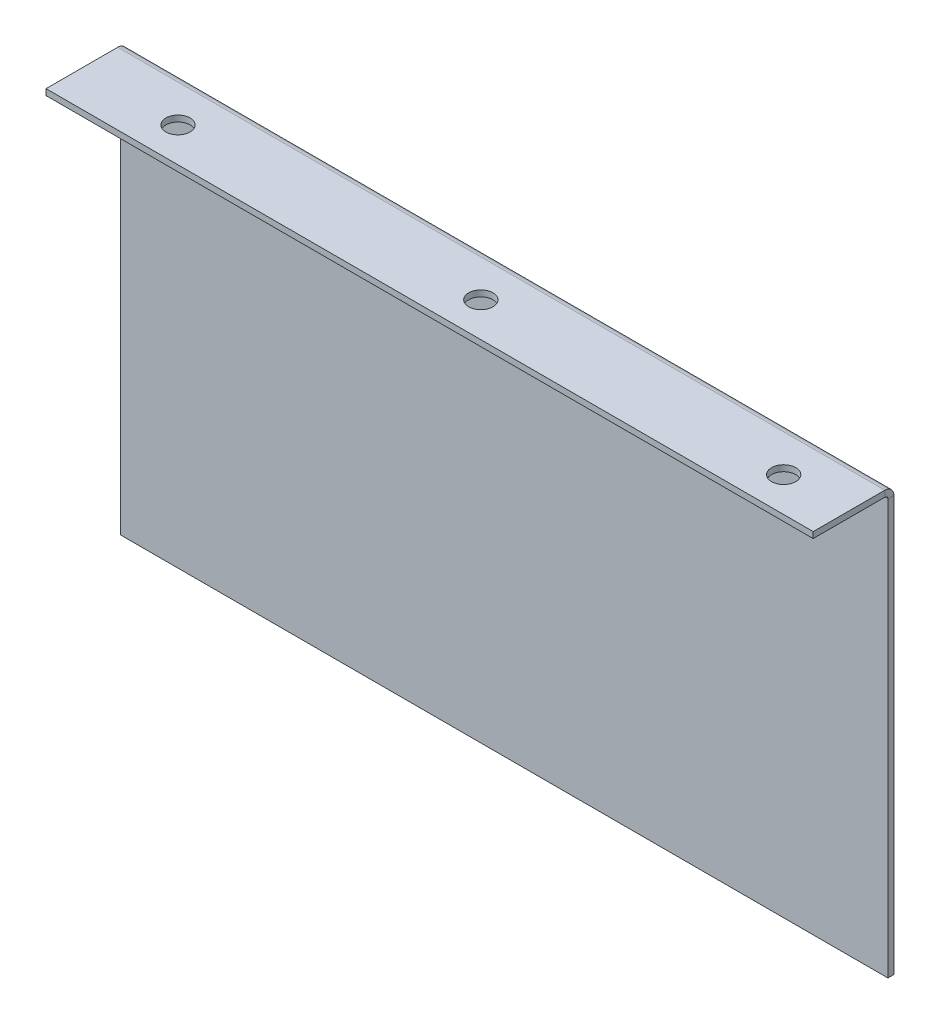
ISO-10303-21;
HEADER;
FILE_DESCRIPTION(('STEP AP214'),'2;1');
FILE_NAME('part.step','',(''),(''),'','','');
FILE_SCHEMA(('AUTOMOTIVE_DESIGN { 1 0 10303 214 1 1 1 1 }'));
ENDSEC;
DATA;
#1=APPLICATION_CONTEXT('core data for automotive mechanical design processes');
#2=APPLICATION_PROTOCOL_DEFINITION('international standard','automotive_design',2000,#1);
#3=PRODUCT_CONTEXT('',#1,'mechanical');
#4=PRODUCT('Part','Part','',(#3));
#5=PRODUCT_RELATED_PRODUCT_CATEGORY('part','',(#4));
#6=PRODUCT_DEFINITION_FORMATION('','',#4);
#7=PRODUCT_DEFINITION_CONTEXT('part definition',#1,'design');
#8=PRODUCT_DEFINITION('design','',#6,#7);
#9=PRODUCT_DEFINITION_SHAPE('','',#8);
#10=(LENGTH_UNIT() NAMED_UNIT(*) SI_UNIT(.MILLI.,.METRE.));
#11=(NAMED_UNIT(*) PLANE_ANGLE_UNIT() SI_UNIT($,.RADIAN.));
#12=(NAMED_UNIT(*) SI_UNIT($,.STERADIAN.) SOLID_ANGLE_UNIT());
#13=UNCERTAINTY_MEASURE_WITH_UNIT(LENGTH_MEASURE(1.E-05),#10,'distance_accuracy_value','');
#14=(GEOMETRIC_REPRESENTATION_CONTEXT(3) GLOBAL_UNCERTAINTY_ASSIGNED_CONTEXT((#13)) GLOBAL_UNIT_ASSIGNED_CONTEXT((#10,
#11,#12)) REPRESENTATION_CONTEXT('',''));
#15=CARTESIAN_POINT('',(0.,0.,0.));
#16=DIRECTION('',(0.,0.,1.));
#17=DIRECTION('',(1.,0.,0.));
#18=AXIS2_PLACEMENT_3D('',#15,#16,#17);
#19=CARTESIAN_POINT('',(72.0220053733779,57.2719298245614,9.94638227487143));
#20=DIRECTION('',(0.,-1.,0.));
#21=DIRECTION('',(0.,0.,-1.));
#22=AXIS2_PLACEMENT_3D('',#19,#20,#21);
#23=CYLINDRICAL_SURFACE('',#22,3.00499841539813);
#24=CARTESIAN_POINT('',(72.0220053733779,47.2719298245614,9.94638227487146));
#25=DIRECTION('',(0.,-1.,0.));
#26=DIRECTION('',(0.,0.,-1.));
#27=AXIS2_PLACEMENT_3D('',#24,#25,#26);
#28=CIRCLE('',#27,3.00499841539813);
#29=CARTESIAN_POINT('',(72.0220053733779,47.2719298245614,6.94138385947334));
#30=VERTEX_POINT('',#29);
#31=EDGE_CURVE('E66',#30,#30,#28,.T.);
#32=ORIENTED_EDGE('',*,*,#31,.T.);
#33=EDGE_LOOP('',(#32));
#34=FACE_BOUND('',#33,.T.);
#35=CARTESIAN_POINT('',(72.0220053733779,48.7719298245614,9.94638227487146));
#36=DIRECTION('',(0.,-1.,0.));
#37=DIRECTION('',(0.,0.,-1.));
#38=AXIS2_PLACEMENT_3D('',#35,#36,#37);
#39=CIRCLE('',#38,3.00499841539813);
#40=CARTESIAN_POINT('',(72.0220053733779,48.7719298245614,6.94138385947333));
#41=VERTEX_POINT('',#40);
#42=EDGE_CURVE('E13',#41,#41,#39,.T.);
#43=ORIENTED_EDGE('',*,*,#42,.F.);
#44=EDGE_LOOP('',(#43));
#45=FACE_BOUND('',#44,.T.);
#46=ADVANCED_FACE('F59',(#34,#45),#23,.F.);
#47=CARTESIAN_POINT('',(-102.105263157895,48.7719298245614,-1.5));
#48=DIRECTION('',(-1.,0.,0.));
#49=DIRECTION('',(0.,-1.,0.));
#50=AXIS2_PLACEMENT_3D('',#47,#48,#49);
#51=PLANE('',#50);
#52=DIRECTION('',(0.,-1.,0.));
#53=VECTOR('',#52,1.);
#54=CARTESIAN_POINT('',(-102.105263157895,48.7719298245614,0.));
#55=LINE('',#54,#53);
#56=CARTESIAN_POINT('',(-102.105263157895,46.5353298245614,0.));
#57=VERTEX_POINT('',#56);
#58=CARTESIAN_POINT('',(-102.105263157895,-56.2280701754386,0.));
#59=VERTEX_POINT('',#58);
#60=EDGE_CURVE('E111',#57,#59,#55,.T.);
#61=ORIENTED_EDGE('',*,*,#60,.F.);
#62=DIRECTION('',(0.,0.,-1.));
#63=VECTOR('',#62,1.);
#64=CARTESIAN_POINT('',(-102.105263157895,46.5353298245614,0.));
#65=LINE('',#64,#63);
#66=CARTESIAN_POINT('',(-102.105263157895,46.5353298245614,-1.5));
#67=VERTEX_POINT('',#66);
#68=EDGE_CURVE('E236',#57,#67,#65,.T.);
#69=ORIENTED_EDGE('',*,*,#68,.T.);
#70=DIRECTION('',(0.,-1.,0.));
#71=VECTOR('',#70,1.);
#72=CARTESIAN_POINT('',(-102.105263157895,48.7719298245614,-1.5));
#73=LINE('',#72,#71);
#74=CARTESIAN_POINT('',(-102.105263157895,-56.2280701754386,-1.5));
#75=VERTEX_POINT('',#74);
#76=EDGE_CURVE('E108',#67,#75,#73,.T.);
#77=ORIENTED_EDGE('',*,*,#76,.T.);
#78=DIRECTION('',(0.,0.,1.));
#79=VECTOR('',#78,1.);
#80=CARTESIAN_POINT('',(-102.105263157895,-56.2280701754386,-1.5));
#81=LINE('',#80,#79);
#82=EDGE_CURVE('E100',#75,#59,#81,.T.);
#83=ORIENTED_EDGE('',*,*,#82,.T.);
#84=EDGE_LOOP('',(#61,#69,#77,#83));
#85=FACE_BOUND('',#84,.T.);
#86=ADVANCED_FACE('F142',(#85),#51,.T.);
#87=CARTESIAN_POINT('',(0.,0.,-1.5));
#88=DIRECTION('',(0.,0.,1.));
#89=DIRECTION('',(1.,0.,0.));
#90=AXIS2_PLACEMENT_3D('',#87,#88,#89);
#91=PLANE('',#90);
#92=DIRECTION('',(-1.,0.,0.));
#93=VECTOR('',#92,1.);
#94=CARTESIAN_POINT('',(-102.105263157895,46.5353298245614,-1.5));
#95=LINE('',#94,#93);
#96=CARTESIAN_POINT('',(87.8947368421053,46.5353298245614,-1.5));
#97=VERTEX_POINT('',#96);
#98=EDGE_CURVE('E229',#67,#97,#95,.F.);
#99=ORIENTED_EDGE('',*,*,#98,.T.);
#100=DIRECTION('',(0.,1.,0.));
#101=VECTOR('',#100,1.);
#102=CARTESIAN_POINT('',(87.8947368421053,48.7719298245614,-1.5));
#103=LINE('',#102,#101);
#104=CARTESIAN_POINT('',(87.8947368421053,-56.2280701754386,-1.5));
#105=VERTEX_POINT('',#104);
#106=EDGE_CURVE('E117',#105,#97,#103,.T.);
#107=ORIENTED_EDGE('',*,*,#106,.F.);
#108=DIRECTION('',(1.,0.,0.));
#109=VECTOR('',#108,1.);
#110=CARTESIAN_POINT('',(-102.105263157895,-56.2280701754386,-1.5));
#111=LINE('',#110,#109);
#112=EDGE_CURVE('E99',#75,#105,#111,.T.);
#113=ORIENTED_EDGE('',*,*,#112,.F.);
#114=ORIENTED_EDGE('',*,*,#76,.F.);
#115=EDGE_LOOP('',(#99,#107,#113,#114));
#116=FACE_BOUND('',#115,.T.);
#117=ADVANCED_FACE('F146',(#116),#91,.F.);
#118=CARTESIAN_POINT('',(0.,0.,0.));
#119=DIRECTION('',(0.,0.,1.));
#120=DIRECTION('',(1.,0.,0.));
#121=AXIS2_PLACEMENT_3D('',#118,#119,#120);
#122=PLANE('',#121);
#123=DIRECTION('',(0.,1.,0.));
#124=VECTOR('',#123,1.);
#125=CARTESIAN_POINT('',(87.8947368421053,48.7719298245614,0.));
#126=LINE('',#125,#124);
#127=CARTESIAN_POINT('',(87.8947368421053,-56.2280701754386,0.));
#128=VERTEX_POINT('',#127);
#129=CARTESIAN_POINT('',(87.8947368421053,46.5353298245614,0.));
#130=VERTEX_POINT('',#129);
#131=EDGE_CURVE('E103',#128,#130,#126,.T.);
#132=ORIENTED_EDGE('',*,*,#131,.T.);
#133=DIRECTION('',(-1.,0.,0.));
#134=VECTOR('',#133,1.);
#135=CARTESIAN_POINT('',(-102.105263157895,46.5353298245614,0.));
#136=LINE('',#135,#134);
#137=EDGE_CURVE('E73',#57,#130,#136,.F.);
#138=ORIENTED_EDGE('',*,*,#137,.F.);
#139=ORIENTED_EDGE('',*,*,#60,.T.);
#140=DIRECTION('',(1.,0.,0.));
#141=VECTOR('',#140,1.);
#142=CARTESIAN_POINT('',(-102.105263157895,-56.2280701754386,0.));
#143=LINE('',#142,#141);
#144=EDGE_CURVE('E97',#59,#128,#143,.T.);
#145=ORIENTED_EDGE('',*,*,#144,.T.);
#146=EDGE_LOOP('',(#132,#138,#139,#145));
#147=FACE_BOUND('',#146,.T.);
#148=ADVANCED_FACE('F110',(#147),#122,.T.);
#149=CARTESIAN_POINT('',(87.8947368421053,48.7719298245614,-1.5));
#150=DIRECTION('',(1.,0.,0.));
#151=DIRECTION('',(0.,1.,0.));
#152=AXIS2_PLACEMENT_3D('',#149,#150,#151);
#153=PLANE('',#152);
#154=DIRECTION('',(0.,0.,-1.));
#155=VECTOR('',#154,1.);
#156=CARTESIAN_POINT('',(87.8947368421053,46.5353298245614,0.));
#157=LINE('',#156,#155);
#158=EDGE_CURVE('E107',#130,#97,#157,.T.);
#159=ORIENTED_EDGE('',*,*,#158,.F.);
#160=ORIENTED_EDGE('',*,*,#131,.F.);
#161=DIRECTION('',(0.,0.,1.));
#162=VECTOR('',#161,1.);
#163=CARTESIAN_POINT('',(87.8947368421053,-56.2280701754386,-1.5));
#164=LINE('',#163,#162);
#165=EDGE_CURVE('E82',#105,#128,#164,.T.);
#166=ORIENTED_EDGE('',*,*,#165,.F.);
#167=ORIENTED_EDGE('',*,*,#106,.T.);
#168=EDGE_LOOP('',(#159,#160,#166,#167));
#169=FACE_BOUND('',#168,.T.);
#170=ADVANCED_FACE('F104',(#169),#153,.T.);
#171=CARTESIAN_POINT('',(-102.105263157895,-56.2280701754386,-1.5));
#172=DIRECTION('',(0.,-1.,0.));
#173=DIRECTION('',(0.,0.,-1.));
#174=AXIS2_PLACEMENT_3D('',#171,#172,#173);
#175=PLANE('',#174);
#176=ORIENTED_EDGE('',*,*,#144,.F.);
#177=ORIENTED_EDGE('',*,*,#82,.F.);
#178=ORIENTED_EDGE('',*,*,#112,.T.);
#179=ORIENTED_EDGE('',*,*,#165,.T.);
#180=EDGE_LOOP('',(#176,#177,#178,#179));
#181=FACE_BOUND('',#180,.T.);
#182=ADVANCED_FACE('F94',(#181),#175,.T.);
#183=CARTESIAN_POINT('',(87.8947368421053,46.5353298245614,0.736599999999996));
#184=DIRECTION('',(1.,0.,0.));
#185=DIRECTION('',(0.,0.,-1.));
#186=AXIS2_PLACEMENT_3D('',#183,#184,#185);
#187=PLANE('',#186);
#188=DIRECTION('',(0.,-1.,0.));
#189=VECTOR('',#188,1.);
#190=CARTESIAN_POINT('',(87.8947368421053,48.7719298245614,0.736599999999992));
#191=LINE('',#190,#189);
#192=CARTESIAN_POINT('',(87.8947368421053,47.2719298245614,0.736599999999993));
#193=VERTEX_POINT('',#192);
#194=CARTESIAN_POINT('',(87.8947368421053,48.7719298245614,0.736599999999988));
#195=VERTEX_POINT('',#194);
#196=EDGE_CURVE('E225',#193,#195,#191,.F.);
#197=ORIENTED_EDGE('',*,*,#196,.F.);
#198=CARTESIAN_POINT('',(87.8947368421053,46.5353298245614,0.736599999999996));
#199=DIRECTION('',(-1.,0.,0.));
#200=DIRECTION('',(0.,0.,1.));
#201=AXIS2_PLACEMENT_3D('',#198,#199,#200);
#202=CIRCLE('',#201,0.736599999999997);
#203=EDGE_CURVE('E238',#130,#193,#202,.F.);
#204=ORIENTED_EDGE('',*,*,#203,.F.);
#205=ORIENTED_EDGE('',*,*,#158,.T.);
#206=CARTESIAN_POINT('',(87.8947368421053,46.5353298245614,0.736599999999996));
#207=DIRECTION('',(-1.,0.,0.));
#208=DIRECTION('',(0.,0.,1.));
#209=AXIS2_PLACEMENT_3D('',#206,#207,#208);
#210=CIRCLE('',#209,2.2366);
#211=EDGE_CURVE('E232',#97,#195,#210,.F.);
#212=ORIENTED_EDGE('',*,*,#211,.T.);
#213=EDGE_LOOP('',(#197,#204,#205,#212));
#214=FACE_BOUND('',#213,.T.);
#215=ADVANCED_FACE('F156',(#214),#187,.T.);
#216=CARTESIAN_POINT('',(-102.105263157895,46.5353298245614,0.736599999999996));
#217=DIRECTION('',(1.,0.,0.));
#218=DIRECTION('',(0.,0.,-1.));
#219=AXIS2_PLACEMENT_3D('',#216,#217,#218);
#220=PLANE('',#219);
#221=CARTESIAN_POINT('',(-102.105263157895,46.5353298245614,0.736599999999996));
#222=DIRECTION('',(-1.,0.,0.));
#223=DIRECTION('',(0.,0.,1.));
#224=AXIS2_PLACEMENT_3D('',#221,#222,#223);
#225=CIRCLE('',#224,0.736599999999997);
#226=CARTESIAN_POINT('',(-102.105263157895,47.2719298245614,0.736599999999993));
#227=VERTEX_POINT('',#226);
#228=EDGE_CURVE('E242',#227,#57,#225,.T.);
#229=ORIENTED_EDGE('',*,*,#228,.F.);
#230=DIRECTION('',(0.,-1.,0.));
#231=VECTOR('',#230,1.);
#232=CARTESIAN_POINT('',(-102.105263157895,47.2719298245614,0.73659999999999));
#233=LINE('',#232,#231);
#234=CARTESIAN_POINT('',(-102.105263157895,48.7719298245614,0.736599999999985));
#235=VERTEX_POINT('',#234);
#236=EDGE_CURVE('E189',#227,#235,#233,.F.);
#237=ORIENTED_EDGE('',*,*,#236,.T.);
#238=CARTESIAN_POINT('',(-102.105263157895,46.5353298245614,0.736599999999996));
#239=DIRECTION('',(-1.,0.,0.));
#240=DIRECTION('',(0.,0.,1.));
#241=AXIS2_PLACEMENT_3D('',#238,#239,#240);
#242=CIRCLE('',#241,2.2366);
#243=EDGE_CURVE('E233',#235,#67,#242,.T.);
#244=ORIENTED_EDGE('',*,*,#243,.T.);
#245=ORIENTED_EDGE('',*,*,#68,.F.);
#246=EDGE_LOOP('',(#229,#237,#244,#245));
#247=FACE_BOUND('',#246,.T.);
#248=ADVANCED_FACE('F161',(#247),#220,.F.);
#249=CARTESIAN_POINT('',(-102.105263157895,46.5353298245614,0.736599999999996));
#250=DIRECTION('',(-1.,0.,0.));
#251=DIRECTION('',(0.,1.,0.));
#252=AXIS2_PLACEMENT_3D('',#249,#250,#251);
#253=CYLINDRICAL_SURFACE('',#252,2.2366);
#254=ORIENTED_EDGE('',*,*,#98,.F.);
#255=ORIENTED_EDGE('',*,*,#243,.F.);
#256=DIRECTION('',(-1.,0.,0.));
#257=VECTOR('',#256,1.);
#258=CARTESIAN_POINT('',(87.8947368421053,48.7719298245614,0.736599999999992));
#259=LINE('',#258,#257);
#260=EDGE_CURVE('E205',#235,#195,#259,.F.);
#261=ORIENTED_EDGE('',*,*,#260,.T.);
#262=ORIENTED_EDGE('',*,*,#211,.F.);
#263=EDGE_LOOP('',(#254,#255,#261,#262));
#264=FACE_BOUND('',#263,.T.);
#265=ADVANCED_FACE('F164',(#264),#253,.T.);
#266=CARTESIAN_POINT('',(-102.105263157895,46.5353298245614,0.736599999999996));
#267=DIRECTION('',(-1.,0.,0.));
#268=DIRECTION('',(0.,1.,0.));
#269=AXIS2_PLACEMENT_3D('',#266,#267,#268);
#270=CYLINDRICAL_SURFACE('',#269,0.736599999999997);
#271=ORIENTED_EDGE('',*,*,#137,.T.);
#272=ORIENTED_EDGE('',*,*,#203,.T.);
#273=DIRECTION('',(-1.,0.,0.));
#274=VECTOR('',#273,1.);
#275=CARTESIAN_POINT('',(87.8947368421053,47.2719298245614,0.736599999999997));
#276=LINE('',#275,#274);
#277=EDGE_CURVE('E206',#193,#227,#276,.T.);
#278=ORIENTED_EDGE('',*,*,#277,.T.);
#279=ORIENTED_EDGE('',*,*,#228,.T.);
#280=EDGE_LOOP('',(#271,#272,#278,#279));
#281=FACE_BOUND('',#280,.T.);
#282=ADVANCED_FACE('F169',(#281),#270,.F.);
#283=CARTESIAN_POINT('',(87.8947368421053,48.7719298245614,0.));
#284=DIRECTION('',(-1.,0.,0.));
#285=DIRECTION('',(0.,0.,1.));
#286=AXIS2_PLACEMENT_3D('',#283,#284,#285);
#287=PLANE('',#286);
#288=ORIENTED_EDGE('',*,*,#196,.T.);
#289=DIRECTION('',(0.,0.,-1.));
#290=VECTOR('',#289,1.);
#291=CARTESIAN_POINT('',(87.8947368421053,48.7719298245614,-1.6987555816356E-13));
#292=LINE('',#291,#290);
#293=CARTESIAN_POINT('',(87.8947368421053,48.7719298245615,18.5));
#294=VERTEX_POINT('',#293);
#295=EDGE_CURVE('E217',#294,#195,#292,.T.);
#296=ORIENTED_EDGE('',*,*,#295,.F.);
#297=DIRECTION('',(0.,-1.,0.));
#298=VECTOR('',#297,1.);
#299=CARTESIAN_POINT('',(87.8947368421053,48.7719298245615,18.5));
#300=LINE('',#299,#298);
#301=CARTESIAN_POINT('',(87.8947368421053,47.2719298245615,18.5));
#302=VERTEX_POINT('',#301);
#303=EDGE_CURVE('E278',#294,#302,#300,.T.);
#304=ORIENTED_EDGE('',*,*,#303,.T.);
#305=DIRECTION('',(0.,0.,1.));
#306=VECTOR('',#305,1.);
#307=CARTESIAN_POINT('',(87.8947368421053,47.2719298245614,0.));
#308=LINE('',#307,#306);
#309=EDGE_CURVE('E215',#302,#193,#308,.F.);
#310=ORIENTED_EDGE('',*,*,#309,.T.);
#311=EDGE_LOOP('',(#288,#296,#304,#310));
#312=FACE_BOUND('',#311,.T.);
#313=ADVANCED_FACE('F172',(#312),#287,.F.);
#314=CARTESIAN_POINT('',(-102.105263157895,48.7719298245615,18.5));
#315=DIRECTION('',(1.,0.,0.));
#316=DIRECTION('',(0.,0.,-1.));
#317=AXIS2_PLACEMENT_3D('',#314,#315,#316);
#318=PLANE('',#317);
#319=ORIENTED_EDGE('',*,*,#236,.F.);
#320=DIRECTION('',(0.,0.,-1.));
#321=VECTOR('',#320,1.);
#322=CARTESIAN_POINT('',(-102.105263157895,47.2719298245615,18.5));
#323=LINE('',#322,#321);
#324=CARTESIAN_POINT('',(-102.105263157895,47.2719298245615,18.5));
#325=VERTEX_POINT('',#324);
#326=EDGE_CURVE('E193',#227,#325,#323,.F.);
#327=ORIENTED_EDGE('',*,*,#326,.T.);
#328=DIRECTION('',(0.,-1.,0.));
#329=VECTOR('',#328,1.);
#330=CARTESIAN_POINT('',(-102.105263157895,48.7719298245615,18.5));
#331=LINE('',#330,#329);
#332=CARTESIAN_POINT('',(-102.105263157895,48.7719298245615,18.5));
#333=VERTEX_POINT('',#332);
#334=EDGE_CURVE('E245',#333,#325,#331,.T.);
#335=ORIENTED_EDGE('',*,*,#334,.F.);
#336=DIRECTION('',(0.,0.,1.));
#337=VECTOR('',#336,1.);
#338=CARTESIAN_POINT('',(-102.105263157895,48.7719298245614,-1.6987555816356E-13));
#339=LINE('',#338,#337);
#340=EDGE_CURVE('E197',#235,#333,#339,.T.);
#341=ORIENTED_EDGE('',*,*,#340,.F.);
#342=EDGE_LOOP('',(#319,#327,#335,#341));
#343=FACE_BOUND('',#342,.T.);
#344=ADVANCED_FACE('F136',(#343),#318,.F.);
#345=CARTESIAN_POINT('',(0.,48.7719298245614,-1.6987555816356E-13));
#346=DIRECTION('',(0.,-1.,0.));
#347=DIRECTION('',(0.,0.,-1.));
#348=AXIS2_PLACEMENT_3D('',#345,#346,#347);
#349=PLANE('',#348);
#350=CARTESIAN_POINT('',(-2.97799462662214,48.7719298245614,9.94638227487146));
#351=DIRECTION('',(0.,-1.,0.));
#352=DIRECTION('',(0.,0.,-1.));
#353=AXIS2_PLACEMENT_3D('',#350,#351,#352);
#354=CIRCLE('',#353,3.00499841539813);
#355=CARTESIAN_POINT('',(-2.97799462662214,48.7719298245614,6.94138385947333));
#356=VERTEX_POINT('',#355);
#357=EDGE_CURVE('E289',#356,#356,#354,.T.);
#358=ORIENTED_EDGE('',*,*,#357,.T.);
#359=EDGE_LOOP('',(#358));
#360=FACE_BOUND('',#359,.T.);
#361=CARTESIAN_POINT('',(-77.9779946266221,48.7719298245614,9.94638227487146));
#362=DIRECTION('',(0.,-1.,0.));
#363=DIRECTION('',(0.,0.,-1.));
#364=AXIS2_PLACEMENT_3D('',#361,#362,#363);
#365=CIRCLE('',#364,3.00499841539813);
#366=CARTESIAN_POINT('',(-77.9779946266221,48.7719298245614,6.94138385947333));
#367=VERTEX_POINT('',#366);
#368=EDGE_CURVE('E228',#367,#367,#365,.T.);
#369=ORIENTED_EDGE('',*,*,#368,.T.);
#370=EDGE_LOOP('',(#369));
#371=FACE_BOUND('',#370,.T.);
#372=ORIENTED_EDGE('',*,*,#260,.F.);
#373=ORIENTED_EDGE('',*,*,#340,.T.);
#374=DIRECTION('',(1.,0.,0.));
#375=VECTOR('',#374,1.);
#376=CARTESIAN_POINT('',(0.,48.7719298245615,18.5));
#377=LINE('',#376,#375);
#378=EDGE_CURVE('E274',#333,#294,#377,.T.);
#379=ORIENTED_EDGE('',*,*,#378,.T.);
#380=ORIENTED_EDGE('',*,*,#295,.T.);
#381=EDGE_LOOP('',(#372,#373,#379,#380));
#382=FACE_BOUND('',#381,.T.);
#383=ORIENTED_EDGE('',*,*,#42,.T.);
#384=EDGE_LOOP('',(#383));
#385=FACE_BOUND('',#384,.T.);
#386=ADVANCED_FACE('F126',(#360,#371,#382,#385),#349,.F.);
#387=CARTESIAN_POINT('',(0.,47.2719298245614,-1.64638336155295E-13));
#388=DIRECTION('',(0.,-1.,0.));
#389=DIRECTION('',(0.,0.,-1.));
#390=AXIS2_PLACEMENT_3D('',#387,#388,#389);
#391=PLANE('',#390);
#392=CARTESIAN_POINT('',(-2.97799462662214,47.2719298245614,9.94638227487146));
#393=DIRECTION('',(0.,-1.,0.));
#394=DIRECTION('',(0.,0.,-1.));
#395=AXIS2_PLACEMENT_3D('',#392,#393,#394);
#396=CIRCLE('',#395,3.00499841539813);
#397=CARTESIAN_POINT('',(-2.97799462662214,47.2719298245614,6.94138385947334));
#398=VERTEX_POINT('',#397);
#399=EDGE_CURVE('E292',#398,#398,#396,.T.);
#400=ORIENTED_EDGE('',*,*,#399,.F.);
#401=EDGE_LOOP('',(#400));
#402=FACE_BOUND('',#401,.T.);
#403=CARTESIAN_POINT('',(-77.9779946266221,47.2719298245614,9.94638227487146));
#404=DIRECTION('',(0.,-1.,0.));
#405=DIRECTION('',(0.,0.,-1.));
#406=AXIS2_PLACEMENT_3D('',#403,#404,#405);
#407=CIRCLE('',#406,3.00499841539813);
#408=CARTESIAN_POINT('',(-77.9779946266221,47.2719298245614,6.94138385947334));
#409=VERTEX_POINT('',#408);
#410=EDGE_CURVE('E286',#409,#409,#407,.T.);
#411=ORIENTED_EDGE('',*,*,#410,.F.);
#412=EDGE_LOOP('',(#411));
#413=FACE_BOUND('',#412,.T.);
#414=ORIENTED_EDGE('',*,*,#326,.F.);
#415=ORIENTED_EDGE('',*,*,#277,.F.);
#416=ORIENTED_EDGE('',*,*,#309,.F.);
#417=DIRECTION('',(-1.,0.,0.));
#418=VECTOR('',#417,1.);
#419=CARTESIAN_POINT('',(87.8947368421053,47.2719298245615,18.5));
#420=LINE('',#419,#418);
#421=EDGE_CURVE('E214',#325,#302,#420,.F.);
#422=ORIENTED_EDGE('',*,*,#421,.F.);
#423=EDGE_LOOP('',(#414,#415,#416,#422));
#424=FACE_BOUND('',#423,.T.);
#425=ORIENTED_EDGE('',*,*,#31,.F.);
#426=EDGE_LOOP('',(#425));
#427=FACE_BOUND('',#426,.T.);
#428=ADVANCED_FACE('F123',(#402,#413,#424,#427),#391,.T.);
#429=CARTESIAN_POINT('',(87.8947368421053,48.7719298245615,18.5));
#430=DIRECTION('',(0.,0.,-1.));
#431=DIRECTION('',(0.,1.,0.));
#432=AXIS2_PLACEMENT_3D('',#429,#430,#431);
#433=PLANE('',#432);
#434=ORIENTED_EDGE('',*,*,#421,.T.);
#435=ORIENTED_EDGE('',*,*,#303,.F.);
#436=ORIENTED_EDGE('',*,*,#378,.F.);
#437=ORIENTED_EDGE('',*,*,#334,.T.);
#438=EDGE_LOOP('',(#434,#435,#436,#437));
#439=FACE_BOUND('',#438,.T.);
#440=ADVANCED_FACE('F125',(#439),#433,.F.);
#441=CARTESIAN_POINT('',(-77.9779946266221,57.2719298245614,9.94638227487143));
#442=DIRECTION('',(0.,-1.,0.));
#443=DIRECTION('',(0.,0.,-1.));
#444=AXIS2_PLACEMENT_3D('',#441,#442,#443);
#445=CYLINDRICAL_SURFACE('',#444,3.00499841539813);
#446=ORIENTED_EDGE('',*,*,#410,.T.);
#447=EDGE_LOOP('',(#446));
#448=FACE_BOUND('',#447,.T.);
#449=ORIENTED_EDGE('',*,*,#368,.F.);
#450=EDGE_LOOP('',(#449));
#451=FACE_BOUND('',#450,.T.);
#452=ADVANCED_FACE('F133',(#448,#451),#445,.F.);
#453=CARTESIAN_POINT('',(-2.97799462662214,57.2719298245614,9.94638227487143));
#454=DIRECTION('',(0.,-1.,0.));
#455=DIRECTION('',(0.,0.,-1.));
#456=AXIS2_PLACEMENT_3D('',#453,#454,#455);
#457=CYLINDRICAL_SURFACE('',#456,3.00499841539813);
#458=ORIENTED_EDGE('',*,*,#399,.T.);
#459=EDGE_LOOP('',(#458));
#460=FACE_BOUND('',#459,.T.);
#461=ORIENTED_EDGE('',*,*,#357,.F.);
#462=EDGE_LOOP('',(#461));
#463=FACE_BOUND('',#462,.T.);
#464=ADVANCED_FACE('F295',(#460,#463),#457,.F.);
#465=CLOSED_SHELL('',(#46,#86,#117,#148,#170,#182,#215,#248,#265,#282,#313,#344,#386,#428,#440,
#452,#464));
#466=MANIFOLD_SOLID_BREP('B2',#465);
#467=ADVANCED_BREP_SHAPE_REPRESENTATION('',(#18,#466),#14);
#468=SHAPE_DEFINITION_REPRESENTATION(#9,#467);
ENDSEC;
END-ISO-10303-21;
